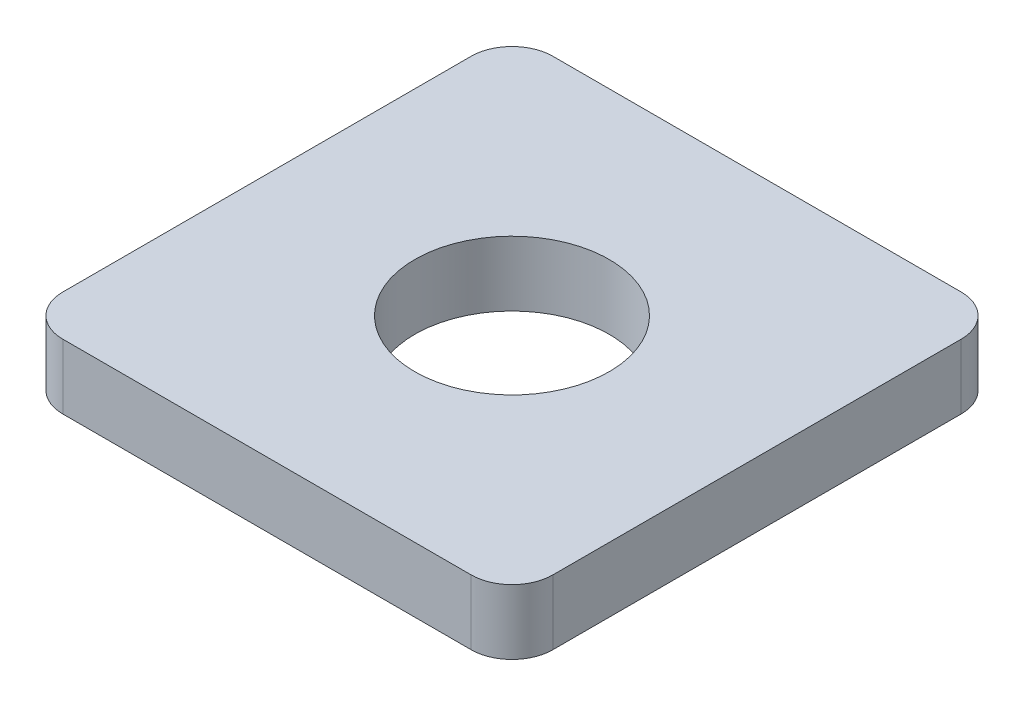
ISO-10303-21;
HEADER;
FILE_DESCRIPTION(('STEP AP214'),'2;1');
FILE_NAME('part.step','',(''),(''),'','','');
FILE_SCHEMA(('AUTOMOTIVE_DESIGN { 1 0 10303 214 1 1 1 1 }'));
ENDSEC;
DATA;
#1=APPLICATION_CONTEXT('core data for automotive mechanical design processes');
#2=APPLICATION_PROTOCOL_DEFINITION('international standard','automotive_design',2000,#1);
#3=PRODUCT_CONTEXT('',#1,'mechanical');
#4=PRODUCT('Part','Part','',(#3));
#5=PRODUCT_RELATED_PRODUCT_CATEGORY('part','',(#4));
#6=PRODUCT_DEFINITION_FORMATION('','',#4);
#7=PRODUCT_DEFINITION_CONTEXT('part definition',#1,'design');
#8=PRODUCT_DEFINITION('design','',#6,#7);
#9=PRODUCT_DEFINITION_SHAPE('','',#8);
#10=(LENGTH_UNIT() NAMED_UNIT(*) SI_UNIT(.MILLI.,.METRE.));
#11=(NAMED_UNIT(*) PLANE_ANGLE_UNIT() SI_UNIT($,.RADIAN.));
#12=(NAMED_UNIT(*) SI_UNIT($,.STERADIAN.) SOLID_ANGLE_UNIT());
#13=UNCERTAINTY_MEASURE_WITH_UNIT(LENGTH_MEASURE(1.E-05),#10,'distance_accuracy_value','');
#14=(GEOMETRIC_REPRESENTATION_CONTEXT(3) GLOBAL_UNCERTAINTY_ASSIGNED_CONTEXT((#13)) GLOBAL_UNIT_ASSIGNED_CONTEXT((#10,
#11,#12)) REPRESENTATION_CONTEXT('',''));
#15=CARTESIAN_POINT('',(0.,0.,0.));
#16=DIRECTION('',(0.,0.,1.));
#17=DIRECTION('',(1.,0.,0.));
#18=AXIS2_PLACEMENT_3D('',#15,#16,#17);
#19=CARTESIAN_POINT('',(-6.,1.5875,6.));
#20=DIRECTION('',(0.,1.,0.));
#21=DIRECTION('',(0.,0.,1.));
#22=AXIS2_PLACEMENT_3D('',#19,#20,#21);
#23=PLANE('',#22);
#24=DIRECTION('',(0.,0.,1.));
#25=VECTOR('',#24,1.);
#26=CARTESIAN_POINT('',(-6.,1.5875,-6.));
#27=LINE('',#26,#25);
#28=CARTESIAN_POINT('',(-6.,1.5875,-5.));
#29=VERTEX_POINT('',#28);
#30=CARTESIAN_POINT('',(-6.,1.5875,5.));
#31=VERTEX_POINT('',#30);
#32=EDGE_CURVE('E137',#29,#31,#27,.T.);
#33=ORIENTED_EDGE('',*,*,#32,.T.);
#34=CARTESIAN_POINT('',(-5.,1.5875,5.));
#35=DIRECTION('',(0.,1.,0.));
#36=DIRECTION('',(0.,0.,1.));
#37=AXIS2_PLACEMENT_3D('',#34,#35,#36);
#38=CIRCLE('',#37,1.);
#39=CARTESIAN_POINT('',(-5.,1.5875,6.));
#40=VERTEX_POINT('',#39);
#41=EDGE_CURVE('E152',#31,#40,#38,.T.);
#42=ORIENTED_EDGE('',*,*,#41,.T.);
#43=DIRECTION('',(1.,0.,0.));
#44=VECTOR('',#43,1.);
#45=CARTESIAN_POINT('',(-6.,1.5875,6.));
#46=LINE('',#45,#44);
#47=CARTESIAN_POINT('',(5.,1.5875,6.));
#48=VERTEX_POINT('',#47);
#49=EDGE_CURVE('E119',#40,#48,#46,.T.);
#50=ORIENTED_EDGE('',*,*,#49,.T.);
#51=CARTESIAN_POINT('',(5.,1.5875,5.));
#52=DIRECTION('',(0.,1.,0.));
#53=DIRECTION('',(0.,0.,1.));
#54=AXIS2_PLACEMENT_3D('',#51,#52,#53);
#55=CIRCLE('',#54,1.);
#56=CARTESIAN_POINT('',(6.,1.5875,5.));
#57=VERTEX_POINT('',#56);
#58=EDGE_CURVE('E150',#48,#57,#55,.T.);
#59=ORIENTED_EDGE('',*,*,#58,.T.);
#60=DIRECTION('',(0.,0.,-1.));
#61=VECTOR('',#60,1.);
#62=CARTESIAN_POINT('',(6.,1.5875,-6.));
#63=LINE('',#62,#61);
#64=CARTESIAN_POINT('',(6.,1.5875,-5.));
#65=VERTEX_POINT('',#64);
#66=EDGE_CURVE('E173',#57,#65,#63,.T.);
#67=ORIENTED_EDGE('',*,*,#66,.T.);
#68=CARTESIAN_POINT('',(5.,1.5875,-5.));
#69=DIRECTION('',(0.,1.,0.));
#70=DIRECTION('',(0.,0.,1.));
#71=AXIS2_PLACEMENT_3D('',#68,#69,#70);
#72=CIRCLE('',#71,1.);
#73=CARTESIAN_POINT('',(5.,1.5875,-6.));
#74=VERTEX_POINT('',#73);
#75=EDGE_CURVE('E54',#65,#74,#72,.T.);
#76=ORIENTED_EDGE('',*,*,#75,.T.);
#77=DIRECTION('',(-1.,0.,0.));
#78=VECTOR('',#77,1.);
#79=CARTESIAN_POINT('',(-6.,1.5875,-6.));
#80=LINE('',#79,#78);
#81=CARTESIAN_POINT('',(-5.,1.5875,-6.));
#82=VERTEX_POINT('',#81);
#83=EDGE_CURVE('E138',#74,#82,#80,.T.);
#84=ORIENTED_EDGE('',*,*,#83,.T.);
#85=CARTESIAN_POINT('',(-5.,1.5875,-5.));
#86=DIRECTION('',(0.,1.,0.));
#87=DIRECTION('',(0.,0.,1.));
#88=AXIS2_PLACEMENT_3D('',#85,#86,#87);
#89=CIRCLE('',#88,1.);
#90=EDGE_CURVE('E148',#82,#29,#89,.T.);
#91=ORIENTED_EDGE('',*,*,#90,.T.);
#92=EDGE_LOOP('',(#33,#42,#50,#59,#67,#76,#84,#91));
#93=FACE_BOUND('',#92,.T.);
#94=CARTESIAN_POINT('',(0.,1.5875,0.));
#95=DIRECTION('',(0.,1.,0.));
#96=DIRECTION('',(0.,0.,1.));
#97=AXIS2_PLACEMENT_3D('',#94,#95,#96);
#98=CIRCLE('',#97,2.38125);
#99=CARTESIAN_POINT('',(0.,1.5875,2.38125));
#100=VERTEX_POINT('',#99);
#101=EDGE_CURVE('E132',#100,#100,#98,.T.);
#102=ORIENTED_EDGE('',*,*,#101,.F.);
#103=EDGE_LOOP('',(#102));
#104=FACE_BOUND('',#103,.T.);
#105=ADVANCED_FACE('F34',(#93,#104),#23,.T.);
#106=CARTESIAN_POINT('',(-6.,0.,6.));
#107=DIRECTION('',(0.,1.,0.));
#108=DIRECTION('',(0.,0.,1.));
#109=AXIS2_PLACEMENT_3D('',#106,#107,#108);
#110=PLANE('',#109);
#111=DIRECTION('',(1.,0.,0.));
#112=VECTOR('',#111,1.);
#113=CARTESIAN_POINT('',(-6.,0.,6.));
#114=LINE('',#113,#112);
#115=CARTESIAN_POINT('',(-5.,0.,6.));
#116=VERTEX_POINT('',#115);
#117=CARTESIAN_POINT('',(5.,0.,6.));
#118=VERTEX_POINT('',#117);
#119=EDGE_CURVE('E116',#116,#118,#114,.T.);
#120=ORIENTED_EDGE('',*,*,#119,.F.);
#121=CARTESIAN_POINT('',(-5.,0.,5.));
#122=DIRECTION('',(0.,1.,0.));
#123=DIRECTION('',(0.,0.,1.));
#124=AXIS2_PLACEMENT_3D('',#121,#122,#123);
#125=CIRCLE('',#124,1.);
#126=CARTESIAN_POINT('',(-6.,0.,5.));
#127=VERTEX_POINT('',#126);
#128=EDGE_CURVE('E99',#116,#127,#125,.F.);
#129=ORIENTED_EDGE('',*,*,#128,.T.);
#130=DIRECTION('',(0.,0.,1.));
#131=VECTOR('',#130,1.);
#132=CARTESIAN_POINT('',(-6.,0.,-6.));
#133=LINE('',#132,#131);
#134=CARTESIAN_POINT('',(-6.,0.,-5.));
#135=VERTEX_POINT('',#134);
#136=EDGE_CURVE('E127',#135,#127,#133,.T.);
#137=ORIENTED_EDGE('',*,*,#136,.F.);
#138=CARTESIAN_POINT('',(-5.,0.,-5.));
#139=DIRECTION('',(0.,1.,0.));
#140=DIRECTION('',(0.,0.,1.));
#141=AXIS2_PLACEMENT_3D('',#138,#139,#140);
#142=CIRCLE('',#141,1.);
#143=CARTESIAN_POINT('',(-5.,0.,-6.));
#144=VERTEX_POINT('',#143);
#145=EDGE_CURVE('E141',#135,#144,#142,.F.);
#146=ORIENTED_EDGE('',*,*,#145,.T.);
#147=DIRECTION('',(-1.,0.,0.));
#148=VECTOR('',#147,1.);
#149=CARTESIAN_POINT('',(-6.,0.,-6.));
#150=LINE('',#149,#148);
#151=CARTESIAN_POINT('',(5.,0.,-6.));
#152=VERTEX_POINT('',#151);
#153=EDGE_CURVE('E130',#152,#144,#150,.T.);
#154=ORIENTED_EDGE('',*,*,#153,.F.);
#155=CARTESIAN_POINT('',(5.,0.,-5.));
#156=DIRECTION('',(0.,1.,0.));
#157=DIRECTION('',(0.,0.,1.));
#158=AXIS2_PLACEMENT_3D('',#155,#156,#157);
#159=CIRCLE('',#158,1.);
#160=CARTESIAN_POINT('',(6.,0.,-5.));
#161=VERTEX_POINT('',#160);
#162=EDGE_CURVE('E120',#152,#161,#159,.F.);
#163=ORIENTED_EDGE('',*,*,#162,.T.);
#164=DIRECTION('',(0.,0.,-1.));
#165=VECTOR('',#164,1.);
#166=CARTESIAN_POINT('',(6.,0.,-6.));
#167=LINE('',#166,#165);
#168=CARTESIAN_POINT('',(6.,0.,5.));
#169=VERTEX_POINT('',#168);
#170=EDGE_CURVE('E126',#169,#161,#167,.T.);
#171=ORIENTED_EDGE('',*,*,#170,.F.);
#172=CARTESIAN_POINT('',(5.,0.,5.));
#173=DIRECTION('',(0.,1.,0.));
#174=DIRECTION('',(0.,0.,1.));
#175=AXIS2_PLACEMENT_3D('',#172,#173,#174);
#176=CIRCLE('',#175,1.);
#177=EDGE_CURVE('E110',#169,#118,#176,.F.);
#178=ORIENTED_EDGE('',*,*,#177,.T.);
#179=EDGE_LOOP('',(#120,#129,#137,#146,#154,#163,#171,#178));
#180=FACE_BOUND('',#179,.T.);
#181=CARTESIAN_POINT('',(0.,0.,0.));
#182=DIRECTION('',(0.,1.,0.));
#183=DIRECTION('',(0.,0.,1.));
#184=AXIS2_PLACEMENT_3D('',#181,#182,#183);
#185=CIRCLE('',#184,2.38125);
#186=CARTESIAN_POINT('',(0.,0.,2.38125));
#187=VERTEX_POINT('',#186);
#188=EDGE_CURVE('E176',#187,#187,#185,.T.);
#189=ORIENTED_EDGE('',*,*,#188,.T.);
#190=EDGE_LOOP('',(#189));
#191=FACE_BOUND('',#190,.T.);
#192=ADVANCED_FACE('F123',(#180,#191),#110,.F.);
#193=CARTESIAN_POINT('',(-6.,1.5875,-6.));
#194=DIRECTION('',(1.,0.,0.));
#195=DIRECTION('',(0.,0.,-1.));
#196=AXIS2_PLACEMENT_3D('',#193,#194,#195);
#197=PLANE('',#196);
#198=ORIENTED_EDGE('',*,*,#136,.T.);
#199=DIRECTION('',(0.,-1.,0.));
#200=VECTOR('',#199,1.);
#201=CARTESIAN_POINT('',(-6.,1.5875,5.));
#202=LINE('',#201,#200);
#203=EDGE_CURVE('E104',#127,#31,#202,.F.);
#204=ORIENTED_EDGE('',*,*,#203,.T.);
#205=ORIENTED_EDGE('',*,*,#32,.F.);
#206=DIRECTION('',(0.,-1.,0.));
#207=VECTOR('',#206,1.);
#208=CARTESIAN_POINT('',(-6.,1.5875,-5.));
#209=LINE('',#208,#207);
#210=EDGE_CURVE('E109',#29,#135,#209,.T.);
#211=ORIENTED_EDGE('',*,*,#210,.T.);
#212=EDGE_LOOP('',(#198,#204,#205,#211));
#213=FACE_BOUND('',#212,.T.);
#214=ADVANCED_FACE('F170',(#213),#197,.F.);
#215=CARTESIAN_POINT('',(-6.,1.5875,6.));
#216=DIRECTION('',(0.,0.,-1.));
#217=DIRECTION('',(-1.,0.,0.));
#218=AXIS2_PLACEMENT_3D('',#215,#216,#217);
#219=PLANE('',#218);
#220=ORIENTED_EDGE('',*,*,#49,.F.);
#221=DIRECTION('',(0.,-1.,0.));
#222=VECTOR('',#221,1.);
#223=CARTESIAN_POINT('',(-5.,1.5875,6.));
#224=LINE('',#223,#222);
#225=EDGE_CURVE('E103',#40,#116,#224,.T.);
#226=ORIENTED_EDGE('',*,*,#225,.T.);
#227=ORIENTED_EDGE('',*,*,#119,.T.);
#228=DIRECTION('',(0.,-1.,0.));
#229=VECTOR('',#228,1.);
#230=CARTESIAN_POINT('',(5.,1.5875,6.));
#231=LINE('',#230,#229);
#232=EDGE_CURVE('E121',#118,#48,#231,.F.);
#233=ORIENTED_EDGE('',*,*,#232,.T.);
#234=EDGE_LOOP('',(#220,#226,#227,#233));
#235=FACE_BOUND('',#234,.T.);
#236=ADVANCED_FACE('F115',(#235),#219,.F.);
#237=CARTESIAN_POINT('',(6.,1.5875,-6.));
#238=DIRECTION('',(-1.,0.,0.));
#239=DIRECTION('',(0.,0.,1.));
#240=AXIS2_PLACEMENT_3D('',#237,#238,#239);
#241=PLANE('',#240);
#242=ORIENTED_EDGE('',*,*,#66,.F.);
#243=DIRECTION('',(0.,-1.,0.));
#244=VECTOR('',#243,1.);
#245=CARTESIAN_POINT('',(6.,1.5875,5.));
#246=LINE('',#245,#244);
#247=EDGE_CURVE('E157',#57,#169,#246,.T.);
#248=ORIENTED_EDGE('',*,*,#247,.T.);
#249=ORIENTED_EDGE('',*,*,#170,.T.);
#250=DIRECTION('',(0.,-1.,0.));
#251=VECTOR('',#250,1.);
#252=CARTESIAN_POINT('',(6.,1.5875,-5.));
#253=LINE('',#252,#251);
#254=EDGE_CURVE('E155',#161,#65,#253,.F.);
#255=ORIENTED_EDGE('',*,*,#254,.T.);
#256=EDGE_LOOP('',(#242,#248,#249,#255));
#257=FACE_BOUND('',#256,.T.);
#258=ADVANCED_FACE('F197',(#257),#241,.F.);
#259=CARTESIAN_POINT('',(-6.,1.5875,-6.));
#260=DIRECTION('',(0.,0.,1.));
#261=DIRECTION('',(1.,0.,0.));
#262=AXIS2_PLACEMENT_3D('',#259,#260,#261);
#263=PLANE('',#262);
#264=ORIENTED_EDGE('',*,*,#153,.T.);
#265=DIRECTION('',(0.,-1.,0.));
#266=VECTOR('',#265,1.);
#267=CARTESIAN_POINT('',(-5.,1.5875,-6.));
#268=LINE('',#267,#266);
#269=EDGE_CURVE('E11',#144,#82,#268,.F.);
#270=ORIENTED_EDGE('',*,*,#269,.T.);
#271=ORIENTED_EDGE('',*,*,#83,.F.);
#272=DIRECTION('',(0.,-1.,0.));
#273=VECTOR('',#272,1.);
#274=CARTESIAN_POINT('',(5.,1.5875,-6.));
#275=LINE('',#274,#273);
#276=EDGE_CURVE('E42',#74,#152,#275,.T.);
#277=ORIENTED_EDGE('',*,*,#276,.T.);
#278=EDGE_LOOP('',(#264,#270,#271,#277));
#279=FACE_BOUND('',#278,.T.);
#280=ADVANCED_FACE('F162',(#279),#263,.F.);
#281=CARTESIAN_POINT('',(0.,1.5875,0.));
#282=DIRECTION('',(0.,-1.,0.));
#283=DIRECTION('',(0.,0.,-1.));
#284=AXIS2_PLACEMENT_3D('',#281,#282,#283);
#285=CYLINDRICAL_SURFACE('',#284,2.38125);
#286=ORIENTED_EDGE('',*,*,#101,.T.);
#287=EDGE_LOOP('',(#286));
#288=FACE_BOUND('',#287,.T.);
#289=ORIENTED_EDGE('',*,*,#188,.F.);
#290=EDGE_LOOP('',(#289));
#291=FACE_BOUND('',#290,.T.);
#292=ADVANCED_FACE('F188',(#288,#291),#285,.F.);
#293=CARTESIAN_POINT('',(-5.,1.5875,5.));
#294=DIRECTION('',(0.,-1.,0.));
#295=DIRECTION('',(0.,0.,-1.));
#296=AXIS2_PLACEMENT_3D('',#293,#294,#295);
#297=CYLINDRICAL_SURFACE('',#296,1.);
#298=ORIENTED_EDGE('',*,*,#41,.F.);
#299=ORIENTED_EDGE('',*,*,#203,.F.);
#300=ORIENTED_EDGE('',*,*,#128,.F.);
#301=ORIENTED_EDGE('',*,*,#225,.F.);
#302=EDGE_LOOP('',(#298,#299,#300,#301));
#303=FACE_BOUND('',#302,.T.);
#304=ADVANCED_FACE('F102',(#303),#297,.T.);
#305=CARTESIAN_POINT('',(5.,1.5875,5.));
#306=DIRECTION('',(0.,-1.,0.));
#307=DIRECTION('',(0.,0.,-1.));
#308=AXIS2_PLACEMENT_3D('',#305,#306,#307);
#309=CYLINDRICAL_SURFACE('',#308,1.);
#310=ORIENTED_EDGE('',*,*,#58,.F.);
#311=ORIENTED_EDGE('',*,*,#232,.F.);
#312=ORIENTED_EDGE('',*,*,#177,.F.);
#313=ORIENTED_EDGE('',*,*,#247,.F.);
#314=EDGE_LOOP('',(#310,#311,#312,#313));
#315=FACE_BOUND('',#314,.T.);
#316=ADVANCED_FACE('F195',(#315),#309,.T.);
#317=CARTESIAN_POINT('',(-5.,1.5875,-5.));
#318=DIRECTION('',(0.,-1.,0.));
#319=DIRECTION('',(0.,0.,-1.));
#320=AXIS2_PLACEMENT_3D('',#317,#318,#319);
#321=CYLINDRICAL_SURFACE('',#320,1.);
#322=ORIENTED_EDGE('',*,*,#90,.F.);
#323=ORIENTED_EDGE('',*,*,#269,.F.);
#324=ORIENTED_EDGE('',*,*,#145,.F.);
#325=ORIENTED_EDGE('',*,*,#210,.F.);
#326=EDGE_LOOP('',(#322,#323,#324,#325));
#327=FACE_BOUND('',#326,.T.);
#328=ADVANCED_FACE('F167',(#327),#321,.T.);
#329=CARTESIAN_POINT('',(5.,1.5875,-5.));
#330=DIRECTION('',(0.,-1.,0.));
#331=DIRECTION('',(0.,0.,-1.));
#332=AXIS2_PLACEMENT_3D('',#329,#330,#331);
#333=CYLINDRICAL_SURFACE('',#332,1.);
#334=ORIENTED_EDGE('',*,*,#75,.F.);
#335=ORIENTED_EDGE('',*,*,#254,.F.);
#336=ORIENTED_EDGE('',*,*,#162,.F.);
#337=ORIENTED_EDGE('',*,*,#276,.F.);
#338=EDGE_LOOP('',(#334,#335,#336,#337));
#339=FACE_BOUND('',#338,.T.);
#340=ADVANCED_FACE('F36',(#339),#333,.T.);
#341=CLOSED_SHELL('',(#105,#192,#214,#236,#258,#280,#292,#304,#316,#328,#340));
#342=MANIFOLD_SOLID_BREP('B2',#341);
#343=ADVANCED_BREP_SHAPE_REPRESENTATION('',(#18,#342),#14);
#344=SHAPE_DEFINITION_REPRESENTATION(#9,#343);
ENDSEC;
END-ISO-10303-21;
